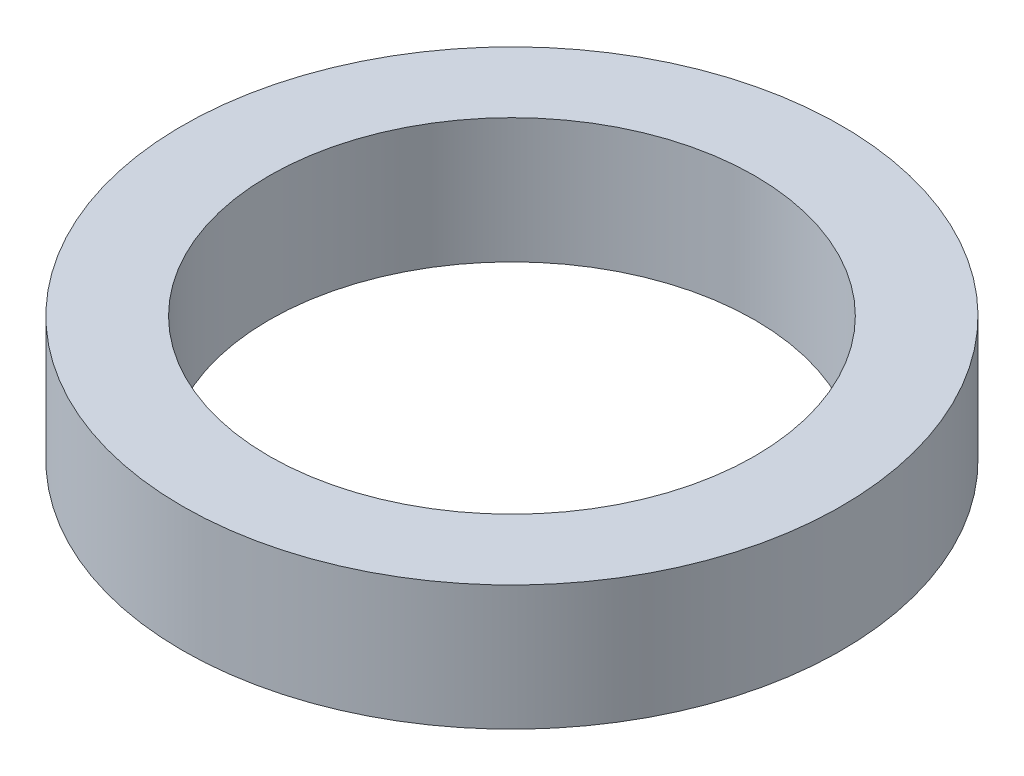
ISO-10303-21;
HEADER;
FILE_DESCRIPTION(('STEP AP214'),'2;1');
FILE_NAME('part.step','',(''),(''),'','','');
FILE_SCHEMA(('AUTOMOTIVE_DESIGN { 1 0 10303 214 1 1 1 1 }'));
ENDSEC;
DATA;
#1=APPLICATION_CONTEXT('core data for automotive mechanical design processes');
#2=APPLICATION_PROTOCOL_DEFINITION('international standard','automotive_design',2000,#1);
#3=PRODUCT_CONTEXT('',#1,'mechanical');
#4=PRODUCT('Part','Part','',(#3));
#5=PRODUCT_RELATED_PRODUCT_CATEGORY('part','',(#4));
#6=PRODUCT_DEFINITION_FORMATION('','',#4);
#7=PRODUCT_DEFINITION_CONTEXT('part definition',#1,'design');
#8=PRODUCT_DEFINITION('design','',#6,#7);
#9=PRODUCT_DEFINITION_SHAPE('','',#8);
#10=(LENGTH_UNIT() NAMED_UNIT(*) SI_UNIT(.MILLI.,.METRE.));
#11=(NAMED_UNIT(*) PLANE_ANGLE_UNIT() SI_UNIT($,.RADIAN.));
#12=(NAMED_UNIT(*) SI_UNIT($,.STERADIAN.) SOLID_ANGLE_UNIT());
#13=UNCERTAINTY_MEASURE_WITH_UNIT(LENGTH_MEASURE(1.E-05),#10,'distance_accuracy_value','');
#14=(GEOMETRIC_REPRESENTATION_CONTEXT(3) GLOBAL_UNCERTAINTY_ASSIGNED_CONTEXT((#13)) GLOBAL_UNIT_ASSIGNED_CONTEXT((#10,
#11,#12)) REPRESENTATION_CONTEXT('',''));
#15=CARTESIAN_POINT('',(0.,0.,0.));
#16=DIRECTION('',(0.,0.,1.));
#17=DIRECTION('',(1.,0.,0.));
#18=AXIS2_PLACEMENT_3D('',#15,#16,#17);
#19=CARTESIAN_POINT('',(0.,18.,0.));
#20=DIRECTION('',(0.,-1.,0.));
#21=DIRECTION('',(0.,0.,-1.));
#22=AXIS2_PLACEMENT_3D('',#19,#20,#21);
#23=CYLINDRICAL_SURFACE('',#22,47.5);
#24=CARTESIAN_POINT('',(0.,18.,0.));
#25=DIRECTION('',(0.,1.,0.));
#26=DIRECTION('',(0.,0.,1.));
#27=AXIS2_PLACEMENT_3D('',#24,#25,#26);
#28=CIRCLE('',#27,47.5);
#29=CARTESIAN_POINT('',(0.,18.,47.5));
#30=VERTEX_POINT('',#29);
#31=EDGE_CURVE('E10',#30,#30,#28,.T.);
#32=ORIENTED_EDGE('',*,*,#31,.F.);
#33=EDGE_LOOP('',(#32));
#34=FACE_BOUND('',#33,.T.);
#35=CARTESIAN_POINT('',(0.,0.,0.));
#36=DIRECTION('',(0.,1.,0.));
#37=DIRECTION('',(0.,0.,1.));
#38=AXIS2_PLACEMENT_3D('',#35,#36,#37);
#39=CIRCLE('',#38,47.5);
#40=CARTESIAN_POINT('',(0.,0.,47.5));
#41=VERTEX_POINT('',#40);
#42=EDGE_CURVE('E37',#41,#41,#39,.T.);
#43=ORIENTED_EDGE('',*,*,#42,.T.);
#44=EDGE_LOOP('',(#43));
#45=FACE_BOUND('',#44,.T.);
#46=ADVANCED_FACE('F40',(#34,#45),#23,.T.);
#47=CARTESIAN_POINT('',(0.,18.,0.));
#48=DIRECTION('',(0.,1.,0.));
#49=DIRECTION('',(0.,0.,1.));
#50=AXIS2_PLACEMENT_3D('',#47,#48,#49);
#51=PLANE('',#50);
#52=CARTESIAN_POINT('',(0.,18.,0.));
#53=DIRECTION('',(0.,1.,0.));
#54=DIRECTION('',(0.,0.,1.));
#55=AXIS2_PLACEMENT_3D('',#52,#53,#54);
#56=CIRCLE('',#55,35.);
#57=CARTESIAN_POINT('',(0.,18.,35.));
#58=VERTEX_POINT('',#57);
#59=EDGE_CURVE('E50',#58,#58,#56,.T.);
#60=ORIENTED_EDGE('',*,*,#59,.F.);
#61=EDGE_LOOP('',(#60));
#62=FACE_BOUND('',#61,.T.);
#63=ORIENTED_EDGE('',*,*,#31,.T.);
#64=EDGE_LOOP('',(#63));
#65=FACE_BOUND('',#64,.T.);
#66=ADVANCED_FACE('F59',(#62,#65),#51,.T.);
#67=CARTESIAN_POINT('',(0.,0.,0.));
#68=DIRECTION('',(0.,1.,0.));
#69=DIRECTION('',(0.,0.,1.));
#70=AXIS2_PLACEMENT_3D('',#67,#68,#69);
#71=PLANE('',#70);
#72=CARTESIAN_POINT('',(0.,0.,0.));
#73=DIRECTION('',(0.,1.,0.));
#74=DIRECTION('',(0.,0.,1.));
#75=AXIS2_PLACEMENT_3D('',#72,#73,#74);
#76=CIRCLE('',#75,35.);
#77=CARTESIAN_POINT('',(0.,0.,35.));
#78=VERTEX_POINT('',#77);
#79=EDGE_CURVE('E47',#78,#78,#76,.T.);
#80=ORIENTED_EDGE('',*,*,#79,.T.);
#81=EDGE_LOOP('',(#80));
#82=FACE_BOUND('',#81,.T.);
#83=ORIENTED_EDGE('',*,*,#42,.F.);
#84=EDGE_LOOP('',(#83));
#85=FACE_BOUND('',#84,.T.);
#86=ADVANCED_FACE('F58',(#82,#85),#71,.F.);
#87=CARTESIAN_POINT('',(0.,18.,0.));
#88=DIRECTION('',(0.,-1.,0.));
#89=DIRECTION('',(0.,0.,-1.));
#90=AXIS2_PLACEMENT_3D('',#87,#88,#89);
#91=CYLINDRICAL_SURFACE('',#90,35.);
#92=ORIENTED_EDGE('',*,*,#59,.T.);
#93=EDGE_LOOP('',(#92));
#94=FACE_BOUND('',#93,.T.);
#95=ORIENTED_EDGE('',*,*,#79,.F.);
#96=EDGE_LOOP('',(#95));
#97=FACE_BOUND('',#96,.T.);
#98=ADVANCED_FACE('F54',(#94,#97),#91,.F.);
#99=CLOSED_SHELL('',(#46,#66,#86,#98));
#100=MANIFOLD_SOLID_BREP('B2',#99);
#101=ADVANCED_BREP_SHAPE_REPRESENTATION('',(#18,#100),#14);
#102=SHAPE_DEFINITION_REPRESENTATION(#9,#101);
ENDSEC;
END-ISO-10303-21;
